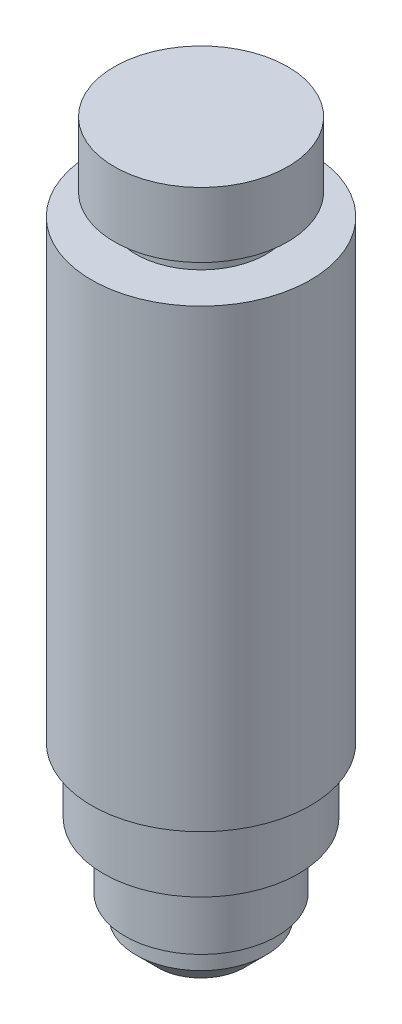
ISO-10303-21;
HEADER;
FILE_DESCRIPTION(('STEP AP214'),'2;1');
FILE_NAME('part.step','',(''),(''),'','','');
FILE_SCHEMA(('AUTOMOTIVE_DESIGN { 1 0 10303 214 1 1 1 1 }'));
ENDSEC;
DATA;
#1=APPLICATION_CONTEXT('core data for automotive mechanical design processes');
#2=APPLICATION_PROTOCOL_DEFINITION('international standard','automotive_design',2000,#1);
#3=PRODUCT_CONTEXT('',#1,'mechanical');
#4=PRODUCT('Part','Part','',(#3));
#5=PRODUCT_RELATED_PRODUCT_CATEGORY('part','',(#4));
#6=PRODUCT_DEFINITION_FORMATION('','',#4);
#7=PRODUCT_DEFINITION_CONTEXT('part definition',#1,'design');
#8=PRODUCT_DEFINITION('design','',#6,#7);
#9=PRODUCT_DEFINITION_SHAPE('','',#8);
#10=(LENGTH_UNIT() NAMED_UNIT(*) SI_UNIT(.MILLI.,.METRE.));
#11=(NAMED_UNIT(*) PLANE_ANGLE_UNIT() SI_UNIT($,.RADIAN.));
#12=(NAMED_UNIT(*) SI_UNIT($,.STERADIAN.) SOLID_ANGLE_UNIT());
#13=UNCERTAINTY_MEASURE_WITH_UNIT(LENGTH_MEASURE(1.E-05),#10,'distance_accuracy_value','');
#14=(GEOMETRIC_REPRESENTATION_CONTEXT(3) GLOBAL_UNCERTAINTY_ASSIGNED_CONTEXT((#13)) GLOBAL_UNIT_ASSIGNED_CONTEXT((#10,
#11,#12)) REPRESENTATION_CONTEXT('',''));
#15=CARTESIAN_POINT('',(0.,0.,0.));
#16=DIRECTION('',(0.,0.,1.));
#17=DIRECTION('',(1.,0.,0.));
#18=AXIS2_PLACEMENT_3D('',#15,#16,#17);
#19=CARTESIAN_POINT('',(12.827,20.32,0.));
#20=DIRECTION('',(0.,-1.,0.));
#21=DIRECTION('',(0.,0.,-1.));
#22=AXIS2_PLACEMENT_3D('',#19,#20,#21);
#23=PLANE('',#22);
#24=CARTESIAN_POINT('',(0.,20.32,0.));
#25=DIRECTION('',(0.,-1.,0.));
#26=DIRECTION('',(0.,0.,-1.));
#27=AXIS2_PLACEMENT_3D('',#24,#25,#26);
#28=CIRCLE('',#27,12.827);
#29=CARTESIAN_POINT('',(0.,20.32,-12.827));
#30=VERTEX_POINT('',#29);
#31=EDGE_CURVE('E10',#30,#30,#28,.T.);
#32=ORIENTED_EDGE('',*,*,#31,.T.);
#33=EDGE_LOOP('',(#32));
#34=FACE_BOUND('',#33,.T.);
#35=CARTESIAN_POINT('',(0.,20.32,0.));
#36=DIRECTION('',(0.,-1.,0.));
#37=DIRECTION('',(0.,0.,-1.));
#38=AXIS2_PLACEMENT_3D('',#35,#36,#37);
#39=CIRCLE('',#38,11.43);
#40=CARTESIAN_POINT('',(0.,20.32,-11.43));
#41=VERTEX_POINT('',#40);
#42=EDGE_CURVE('E80',#41,#41,#39,.T.);
#43=ORIENTED_EDGE('',*,*,#42,.F.);
#44=EDGE_LOOP('',(#43));
#45=FACE_BOUND('',#44,.T.);
#46=ADVANCED_FACE('F30',(#34,#45),#23,.T.);
#47=CARTESIAN_POINT('',(0.,0.,0.));
#48=DIRECTION('',(0.,-1.,0.));
#49=DIRECTION('',(0.,0.,-1.));
#50=AXIS2_PLACEMENT_3D('',#47,#48,#49);
#51=CYLINDRICAL_SURFACE('',#50,12.827);
#52=CARTESIAN_POINT('',(0.,73.66,0.));
#53=DIRECTION('',(0.,-1.,0.));
#54=DIRECTION('',(0.,0.,-1.));
#55=AXIS2_PLACEMENT_3D('',#52,#53,#54);
#56=CIRCLE('',#55,12.827);
#57=CARTESIAN_POINT('',(0.,73.66,-12.827));
#58=VERTEX_POINT('',#57);
#59=EDGE_CURVE('E37',#58,#58,#56,.T.);
#60=ORIENTED_EDGE('',*,*,#59,.T.);
#61=EDGE_LOOP('',(#60));
#62=FACE_BOUND('',#61,.T.);
#63=ORIENTED_EDGE('',*,*,#31,.F.);
#64=EDGE_LOOP('',(#63));
#65=FACE_BOUND('',#64,.T.);
#66=ADVANCED_FACE('F88',(#62,#65),#51,.T.);
#67=CARTESIAN_POINT('',(7.62,73.66,0.));
#68=DIRECTION('',(0.,1.,0.));
#69=DIRECTION('',(0.,0.,1.));
#70=AXIS2_PLACEMENT_3D('',#67,#68,#69);
#71=PLANE('',#70);
#72=CARTESIAN_POINT('',(0.,73.66,0.));
#73=DIRECTION('',(0.,-1.,0.));
#74=DIRECTION('',(0.,0.,-1.));
#75=AXIS2_PLACEMENT_3D('',#72,#73,#74);
#76=CIRCLE('',#75,7.62);
#77=CARTESIAN_POINT('',(0.,73.66,-7.62));
#78=VERTEX_POINT('',#77);
#79=EDGE_CURVE('E41',#78,#78,#76,.T.);
#80=ORIENTED_EDGE('',*,*,#79,.T.);
#81=EDGE_LOOP('',(#80));
#82=FACE_BOUND('',#81,.T.);
#83=ORIENTED_EDGE('',*,*,#59,.F.);
#84=EDGE_LOOP('',(#83));
#85=FACE_BOUND('',#84,.T.);
#86=ADVANCED_FACE('F92',(#82,#85),#71,.T.);
#87=CARTESIAN_POINT('',(0.,0.,0.));
#88=DIRECTION('',(0.,-1.,0.));
#89=DIRECTION('',(0.,0.,-1.));
#90=AXIS2_PLACEMENT_3D('',#87,#88,#89);
#91=CYLINDRICAL_SURFACE('',#90,7.62);
#92=CARTESIAN_POINT('',(0.,76.2,0.));
#93=DIRECTION('',(0.,-1.,0.));
#94=DIRECTION('',(0.,0.,-1.));
#95=AXIS2_PLACEMENT_3D('',#92,#93,#94);
#96=CIRCLE('',#95,7.62);
#97=CARTESIAN_POINT('',(0.,76.2,-7.62));
#98=VERTEX_POINT('',#97);
#99=EDGE_CURVE('E45',#98,#98,#96,.T.);
#100=ORIENTED_EDGE('',*,*,#99,.T.);
#101=EDGE_LOOP('',(#100));
#102=FACE_BOUND('',#101,.T.);
#103=ORIENTED_EDGE('',*,*,#79,.F.);
#104=EDGE_LOOP('',(#103));
#105=FACE_BOUND('',#104,.T.);
#106=ADVANCED_FACE('F97',(#102,#105),#91,.T.);
#107=CARTESIAN_POINT('',(10.16,76.2,0.));
#108=DIRECTION('',(0.,-1.,0.));
#109=DIRECTION('',(0.,0.,-1.));
#110=AXIS2_PLACEMENT_3D('',#107,#108,#109);
#111=PLANE('',#110);
#112=CARTESIAN_POINT('',(0.,76.2,0.));
#113=DIRECTION('',(0.,-1.,0.));
#114=DIRECTION('',(0.,0.,-1.));
#115=AXIS2_PLACEMENT_3D('',#112,#113,#114);
#116=CIRCLE('',#115,10.16);
#117=CARTESIAN_POINT('',(0.,76.2,-10.16));
#118=VERTEX_POINT('',#117);
#119=EDGE_CURVE('E50',#118,#118,#116,.T.);
#120=ORIENTED_EDGE('',*,*,#119,.T.);
#121=EDGE_LOOP('',(#120));
#122=FACE_BOUND('',#121,.T.);
#123=ORIENTED_EDGE('',*,*,#99,.F.);
#124=EDGE_LOOP('',(#123));
#125=FACE_BOUND('',#124,.T.);
#126=ADVANCED_FACE('F101',(#122,#125),#111,.T.);
#127=CARTESIAN_POINT('',(0.,0.,0.));
#128=DIRECTION('',(0.,-1.,0.));
#129=DIRECTION('',(0.,0.,-1.));
#130=AXIS2_PLACEMENT_3D('',#127,#128,#129);
#131=CYLINDRICAL_SURFACE('',#130,10.16);
#132=CARTESIAN_POINT('',(0.,83.82,0.));
#133=DIRECTION('',(0.,-1.,0.));
#134=DIRECTION('',(0.,0.,-1.));
#135=AXIS2_PLACEMENT_3D('',#132,#133,#134);
#136=CIRCLE('',#135,10.16);
#137=CARTESIAN_POINT('',(0.,83.82,-10.16));
#138=VERTEX_POINT('',#137);
#139=EDGE_CURVE('E53',#138,#138,#136,.T.);
#140=ORIENTED_EDGE('',*,*,#139,.T.);
#141=EDGE_LOOP('',(#140));
#142=FACE_BOUND('',#141,.T.);
#143=ORIENTED_EDGE('',*,*,#119,.F.);
#144=EDGE_LOOP('',(#143));
#145=FACE_BOUND('',#144,.T.);
#146=ADVANCED_FACE('F105',(#142,#145),#131,.T.);
#147=CARTESIAN_POINT('',(0.,83.82,0.));
#148=DIRECTION('',(0.,1.,0.));
#149=DIRECTION('',(0.,0.,1.));
#150=AXIS2_PLACEMENT_3D('',#147,#148,#149);
#151=PLANE('',#150);
#152=ORIENTED_EDGE('',*,*,#139,.F.);
#153=EDGE_LOOP('',(#152));
#154=FACE_BOUND('',#153,.T.);
#155=ADVANCED_FACE('F109',(#154),#151,.T.);
#156=CARTESIAN_POINT('',(5.08,0.,0.));
#157=DIRECTION('',(0.,-1.,0.));
#158=DIRECTION('',(0.,0.,-1.));
#159=AXIS2_PLACEMENT_3D('',#156,#157,#158);
#160=PLANE('',#159);
#161=CARTESIAN_POINT('',(0.,0.,0.));
#162=DIRECTION('',(0.,-1.,0.));
#163=DIRECTION('',(0.,0.,-1.));
#164=AXIS2_PLACEMENT_3D('',#161,#162,#163);
#165=CIRCLE('',#164,5.08);
#166=CARTESIAN_POINT('',(0.,0.,-5.08));
#167=VERTEX_POINT('',#166);
#168=EDGE_CURVE('E56',#167,#167,#165,.T.);
#169=ORIENTED_EDGE('',*,*,#168,.T.);
#170=EDGE_LOOP('',(#169));
#171=FACE_BOUND('',#170,.T.);
#172=ADVANCED_FACE('F113',(#171),#160,.T.);
#173=CARTESIAN_POINT('',(0.,0.,0.));
#174=DIRECTION('',(0.,-1.,0.));
#175=DIRECTION('',(0.,0.,-1.));
#176=AXIS2_PLACEMENT_3D('',#173,#174,#175);
#177=CYLINDRICAL_SURFACE('',#176,7.62);
#178=CARTESIAN_POINT('',(0.,5.08,0.));
#179=DIRECTION('',(0.,-1.,0.));
#180=DIRECTION('',(0.,0.,-1.));
#181=AXIS2_PLACEMENT_3D('',#178,#179,#180);
#182=CIRCLE('',#181,7.62);
#183=CARTESIAN_POINT('',(0.,5.08,-7.62));
#184=VERTEX_POINT('',#183);
#185=EDGE_CURVE('E62',#184,#184,#182,.T.);
#186=ORIENTED_EDGE('',*,*,#185,.T.);
#187=EDGE_LOOP('',(#186));
#188=FACE_BOUND('',#187,.T.);
#189=CARTESIAN_POINT('',(0.,2.54,0.));
#190=DIRECTION('',(0.,-1.,0.));
#191=DIRECTION('',(0.,0.,-1.));
#192=AXIS2_PLACEMENT_3D('',#189,#190,#191);
#193=CIRCLE('',#192,7.62);
#194=CARTESIAN_POINT('',(0.,2.54,-7.62));
#195=VERTEX_POINT('',#194);
#196=EDGE_CURVE('E59',#195,#195,#193,.T.);
#197=ORIENTED_EDGE('',*,*,#196,.F.);
#198=EDGE_LOOP('',(#197));
#199=FACE_BOUND('',#198,.T.);
#200=ADVANCED_FACE('F117',(#188,#199),#177,.T.);
#201=CARTESIAN_POINT('',(8.89,5.08,0.));
#202=DIRECTION('',(0.,-1.,0.));
#203=DIRECTION('',(0.,0.,-1.));
#204=AXIS2_PLACEMENT_3D('',#201,#202,#203);
#205=PLANE('',#204);
#206=CARTESIAN_POINT('',(0.,5.08,0.));
#207=DIRECTION('',(0.,-1.,0.));
#208=DIRECTION('',(0.,0.,-1.));
#209=AXIS2_PLACEMENT_3D('',#206,#207,#208);
#210=CIRCLE('',#209,8.89);
#211=CARTESIAN_POINT('',(0.,5.08,-8.89));
#212=VERTEX_POINT('',#211);
#213=EDGE_CURVE('E65',#212,#212,#210,.T.);
#214=ORIENTED_EDGE('',*,*,#213,.T.);
#215=EDGE_LOOP('',(#214));
#216=FACE_BOUND('',#215,.T.);
#217=ORIENTED_EDGE('',*,*,#185,.F.);
#218=EDGE_LOOP('',(#217));
#219=FACE_BOUND('',#218,.T.);
#220=ADVANCED_FACE('F121',(#216,#219),#205,.T.);
#221=CARTESIAN_POINT('',(0.,0.,0.));
#222=DIRECTION('',(0.,-1.,0.));
#223=DIRECTION('',(0.,0.,-1.));
#224=AXIS2_PLACEMENT_3D('',#221,#222,#223);
#225=CYLINDRICAL_SURFACE('',#224,8.89);
#226=CARTESIAN_POINT('',(0.,11.43,0.));
#227=DIRECTION('',(0.,-1.,0.));
#228=DIRECTION('',(0.,0.,-1.));
#229=AXIS2_PLACEMENT_3D('',#226,#227,#228);
#230=CIRCLE('',#229,8.89);
#231=CARTESIAN_POINT('',(0.,11.43,-8.89));
#232=VERTEX_POINT('',#231);
#233=EDGE_CURVE('E68',#232,#232,#230,.T.);
#234=ORIENTED_EDGE('',*,*,#233,.T.);
#235=EDGE_LOOP('',(#234));
#236=FACE_BOUND('',#235,.T.);
#237=ORIENTED_EDGE('',*,*,#213,.F.);
#238=EDGE_LOOP('',(#237));
#239=FACE_BOUND('',#238,.T.);
#240=ADVANCED_FACE('F125',(#236,#239),#225,.T.);
#241=CARTESIAN_POINT('',(7.62,11.43,0.));
#242=DIRECTION('',(0.,1.,0.));
#243=DIRECTION('',(0.,0.,1.));
#244=AXIS2_PLACEMENT_3D('',#241,#242,#243);
#245=PLANE('',#244);
#246=CARTESIAN_POINT('',(0.,11.43,0.));
#247=DIRECTION('',(0.,-1.,0.));
#248=DIRECTION('',(0.,0.,-1.));
#249=AXIS2_PLACEMENT_3D('',#246,#247,#248);
#250=CIRCLE('',#249,7.62);
#251=CARTESIAN_POINT('',(0.,11.43,-7.62));
#252=VERTEX_POINT('',#251);
#253=EDGE_CURVE('E71',#252,#252,#250,.T.);
#254=ORIENTED_EDGE('',*,*,#253,.T.);
#255=EDGE_LOOP('',(#254));
#256=FACE_BOUND('',#255,.T.);
#257=ORIENTED_EDGE('',*,*,#233,.F.);
#258=EDGE_LOOP('',(#257));
#259=FACE_BOUND('',#258,.T.);
#260=ADVANCED_FACE('F129',(#256,#259),#245,.T.);
#261=CARTESIAN_POINT('',(0.,0.,0.));
#262=DIRECTION('',(0.,-1.,0.));
#263=DIRECTION('',(0.,0.,-1.));
#264=AXIS2_PLACEMENT_3D('',#261,#262,#263);
#265=CYLINDRICAL_SURFACE('',#264,7.62);
#266=CARTESIAN_POINT('',(0.,12.7,0.));
#267=DIRECTION('',(0.,-1.,0.));
#268=DIRECTION('',(0.,0.,-1.));
#269=AXIS2_PLACEMENT_3D('',#266,#267,#268);
#270=CIRCLE('',#269,7.62);
#271=CARTESIAN_POINT('',(0.,12.7,-7.62));
#272=VERTEX_POINT('',#271);
#273=EDGE_CURVE('E74',#272,#272,#270,.T.);
#274=ORIENTED_EDGE('',*,*,#273,.T.);
#275=EDGE_LOOP('',(#274));
#276=FACE_BOUND('',#275,.T.);
#277=ORIENTED_EDGE('',*,*,#253,.F.);
#278=EDGE_LOOP('',(#277));
#279=FACE_BOUND('',#278,.T.);
#280=ADVANCED_FACE('F133',(#276,#279),#265,.T.);
#281=CARTESIAN_POINT('',(11.43,12.7,0.));
#282=DIRECTION('',(0.,-1.,0.));
#283=DIRECTION('',(0.,0.,-1.));
#284=AXIS2_PLACEMENT_3D('',#281,#282,#283);
#285=PLANE('',#284);
#286=CARTESIAN_POINT('',(0.,12.7,0.));
#287=DIRECTION('',(0.,-1.,0.));
#288=DIRECTION('',(0.,0.,-1.));
#289=AXIS2_PLACEMENT_3D('',#286,#287,#288);
#290=CIRCLE('',#289,11.43);
#291=CARTESIAN_POINT('',(0.,12.7,-11.43));
#292=VERTEX_POINT('',#291);
#293=EDGE_CURVE('E77',#292,#292,#290,.T.);
#294=ORIENTED_EDGE('',*,*,#293,.T.);
#295=EDGE_LOOP('',(#294));
#296=FACE_BOUND('',#295,.T.);
#297=ORIENTED_EDGE('',*,*,#273,.F.);
#298=EDGE_LOOP('',(#297));
#299=FACE_BOUND('',#298,.T.);
#300=ADVANCED_FACE('F137',(#296,#299),#285,.T.);
#301=CARTESIAN_POINT('',(0.,0.,0.));
#302=DIRECTION('',(0.,-1.,0.));
#303=DIRECTION('',(0.,0.,-1.));
#304=AXIS2_PLACEMENT_3D('',#301,#302,#303);
#305=CYLINDRICAL_SURFACE('',#304,11.43);
#306=ORIENTED_EDGE('',*,*,#42,.T.);
#307=EDGE_LOOP('',(#306));
#308=FACE_BOUND('',#307,.T.);
#309=ORIENTED_EDGE('',*,*,#293,.F.);
#310=EDGE_LOOP('',(#309));
#311=FACE_BOUND('',#310,.T.);
#312=ADVANCED_FACE('F84',(#308,#311),#305,.T.);
#313=CARTESIAN_POINT('',(0.,0.,0.));
#314=DIRECTION('',(0.,1.,0.));
#315=DIRECTION('',(0.,0.,1.));
#316=AXIS2_PLACEMENT_3D('',#313,#314,#315);
#317=CONICAL_SURFACE('',#316,5.08,0.785398163397445);
#318=ORIENTED_EDGE('',*,*,#196,.T.);
#319=EDGE_LOOP('',(#318));
#320=FACE_BOUND('',#319,.T.);
#321=ORIENTED_EDGE('',*,*,#168,.F.);
#322=EDGE_LOOP('',(#321));
#323=FACE_BOUND('',#322,.T.);
#324=ADVANCED_FACE('F32',(#320,#323),#317,.T.);
#325=CLOSED_SHELL('',(#46,#66,#86,#106,#126,#146,#155,#172,#200,#220,#240,#260,#280,#300,#312,#324));
#326=MANIFOLD_SOLID_BREP('B2',#325);
#327=ADVANCED_BREP_SHAPE_REPRESENTATION('',(#18,#326),#14);
#328=SHAPE_DEFINITION_REPRESENTATION(#9,#327);
ENDSEC;
END-ISO-10303-21;
